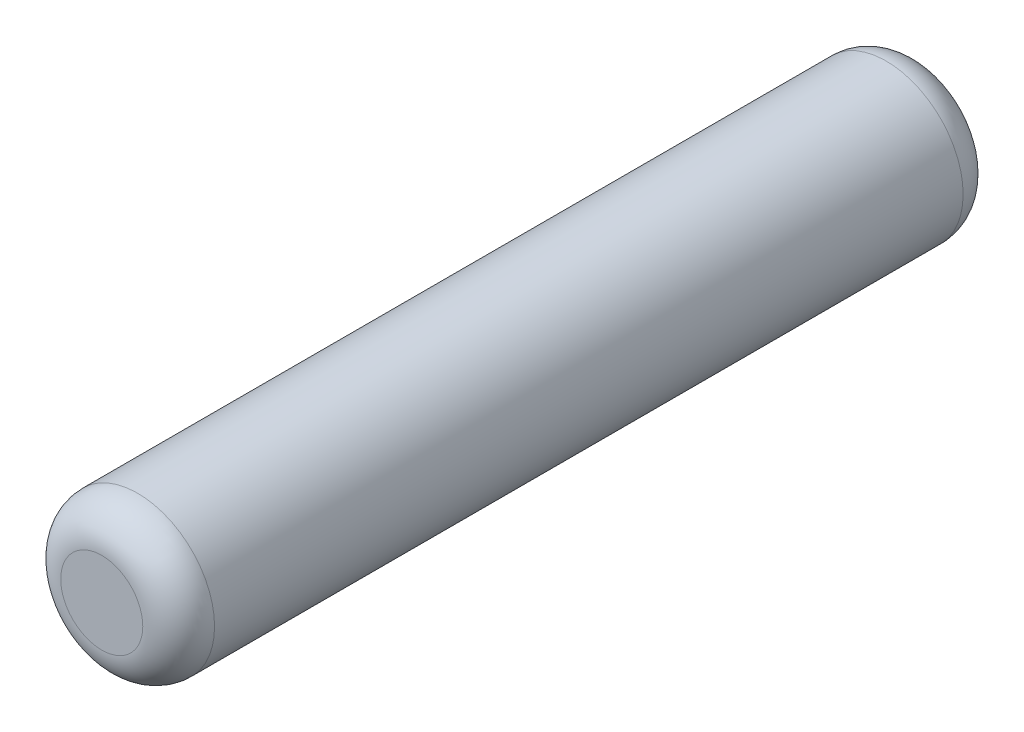
ISO-10303-21;
HEADER;
FILE_DESCRIPTION(('STEP AP214'),'2;1');
FILE_NAME('part.step','',(''),(''),'','','');
FILE_SCHEMA(('AUTOMOTIVE_DESIGN { 1 0 10303 214 1 1 1 1 }'));
ENDSEC;
DATA;
#1=APPLICATION_CONTEXT('core data for automotive mechanical design processes');
#2=APPLICATION_PROTOCOL_DEFINITION('international standard','automotive_design',2000,#1);
#3=PRODUCT_CONTEXT('',#1,'mechanical');
#4=PRODUCT('Part','Part','',(#3));
#5=PRODUCT_RELATED_PRODUCT_CATEGORY('part','',(#4));
#6=PRODUCT_DEFINITION_FORMATION('','',#4);
#7=PRODUCT_DEFINITION_CONTEXT('part definition',#1,'design');
#8=PRODUCT_DEFINITION('design','',#6,#7);
#9=PRODUCT_DEFINITION_SHAPE('','',#8);
#10=(LENGTH_UNIT() NAMED_UNIT(*) SI_UNIT(.MILLI.,.METRE.));
#11=(NAMED_UNIT(*) PLANE_ANGLE_UNIT() SI_UNIT($,.RADIAN.));
#12=(NAMED_UNIT(*) SI_UNIT($,.STERADIAN.) SOLID_ANGLE_UNIT());
#13=UNCERTAINTY_MEASURE_WITH_UNIT(LENGTH_MEASURE(1.E-05),#10,'distance_accuracy_value','');
#14=(GEOMETRIC_REPRESENTATION_CONTEXT(3) GLOBAL_UNCERTAINTY_ASSIGNED_CONTEXT((#13)) GLOBAL_UNIT_ASSIGNED_CONTEXT((#10,
#11,#12)) REPRESENTATION_CONTEXT('',''));
#15=CARTESIAN_POINT('',(0.,0.,0.));
#16=DIRECTION('',(0.,0.,1.));
#17=DIRECTION('',(1.,0.,0.));
#18=AXIS2_PLACEMENT_3D('',#15,#16,#17);
#19=CARTESIAN_POINT('',(0.,0.,4.));
#20=DIRECTION('',(0.,0.,-1.));
#21=DIRECTION('',(-1.,0.,0.));
#22=AXIS2_PLACEMENT_3D('',#19,#20,#21);
#23=CYLINDRICAL_SURFACE('',#22,0.75);
#24=CARTESIAN_POINT('',(0.,0.,-3.65));
#25=DIRECTION('',(0.,0.,1.));
#26=DIRECTION('',(1.,0.,0.));
#27=AXIS2_PLACEMENT_3D('',#24,#25,#26);
#28=CIRCLE('',#27,0.75);
#29=CARTESIAN_POINT('',(0.75,0.,-3.65));
#30=VERTEX_POINT('',#29);
#31=EDGE_CURVE('E42',#30,#30,#28,.T.);
#32=ORIENTED_EDGE('',*,*,#31,.T.);
#33=EDGE_LOOP('',(#32));
#34=FACE_BOUND('',#33,.T.);
#35=CARTESIAN_POINT('',(0.,0.,3.65));
#36=DIRECTION('',(0.,0.,1.));
#37=DIRECTION('',(1.,0.,0.));
#38=AXIS2_PLACEMENT_3D('',#35,#36,#37);
#39=CIRCLE('',#38,0.75);
#40=CARTESIAN_POINT('',(0.75,0.,3.65));
#41=VERTEX_POINT('',#40);
#42=EDGE_CURVE('E46',#41,#41,#39,.F.);
#43=ORIENTED_EDGE('',*,*,#42,.T.);
#44=EDGE_LOOP('',(#43));
#45=FACE_BOUND('',#44,.T.);
#46=ADVANCED_FACE('F31',(#34,#45),#23,.T.);
#47=CARTESIAN_POINT('',(0.,0.,4.));
#48=DIRECTION('',(0.,0.,1.));
#49=DIRECTION('',(1.,0.,0.));
#50=AXIS2_PLACEMENT_3D('',#47,#48,#49);
#51=PLANE('',#50);
#52=CARTESIAN_POINT('',(0.,0.,4.));
#53=DIRECTION('',(0.,0.,1.));
#54=DIRECTION('',(1.,0.,0.));
#55=AXIS2_PLACEMENT_3D('',#52,#53,#54);
#56=CIRCLE('',#55,0.4);
#57=CARTESIAN_POINT('',(0.4,0.,4.));
#58=VERTEX_POINT('',#57);
#59=EDGE_CURVE('E10',#58,#58,#56,.T.);
#60=ORIENTED_EDGE('',*,*,#59,.T.);
#61=EDGE_LOOP('',(#60));
#62=FACE_BOUND('',#61,.T.);
#63=ADVANCED_FACE('F62',(#62),#51,.T.);
#64=CARTESIAN_POINT('',(0.,0.,-4.));
#65=DIRECTION('',(0.,0.,1.));
#66=DIRECTION('',(1.,0.,0.));
#67=AXIS2_PLACEMENT_3D('',#64,#65,#66);
#68=PLANE('',#67);
#69=CARTESIAN_POINT('',(0.,0.,-4.));
#70=DIRECTION('',(0.,0.,1.));
#71=DIRECTION('',(1.,0.,0.));
#72=AXIS2_PLACEMENT_3D('',#69,#70,#71);
#73=CIRCLE('',#72,0.4);
#74=CARTESIAN_POINT('',(0.4,0.,-4.));
#75=VERTEX_POINT('',#74);
#76=EDGE_CURVE('E38',#75,#75,#73,.F.);
#77=ORIENTED_EDGE('',*,*,#76,.T.);
#78=EDGE_LOOP('',(#77));
#79=FACE_BOUND('',#78,.T.);
#80=ADVANCED_FACE('F59',(#79),#68,.F.);
#81=CARTESIAN_POINT('',(0.,0.,-3.65));
#82=DIRECTION('',(0.,0.,1.));
#83=DIRECTION('',(1.,0.,0.));
#84=AXIS2_PLACEMENT_3D('',#81,#82,#83);
#85=TOROIDAL_SURFACE('',#84,0.4,0.35);
#86=ORIENTED_EDGE('',*,*,#76,.F.);
#87=EDGE_LOOP('',(#86));
#88=FACE_BOUND('',#87,.T.);
#89=ORIENTED_EDGE('',*,*,#31,.F.);
#90=EDGE_LOOP('',(#89));
#91=FACE_BOUND('',#90,.T.);
#92=ADVANCED_FACE('F55',(#88,#91),#85,.T.);
#93=CARTESIAN_POINT('',(0.,0.,3.65));
#94=DIRECTION('',(0.,0.,1.));
#95=DIRECTION('',(1.,0.,0.));
#96=AXIS2_PLACEMENT_3D('',#93,#94,#95);
#97=TOROIDAL_SURFACE('',#96,0.4,0.35);
#98=ORIENTED_EDGE('',*,*,#42,.F.);
#99=EDGE_LOOP('',(#98));
#100=FACE_BOUND('',#99,.T.);
#101=ORIENTED_EDGE('',*,*,#59,.F.);
#102=EDGE_LOOP('',(#101));
#103=FACE_BOUND('',#102,.T.);
#104=ADVANCED_FACE('F33',(#100,#103),#97,.T.);
#105=CLOSED_SHELL('',(#46,#63,#80,#92,#104));
#106=MANIFOLD_SOLID_BREP('B2',#105);
#107=ADVANCED_BREP_SHAPE_REPRESENTATION('',(#18,#106),#14);
#108=SHAPE_DEFINITION_REPRESENTATION(#9,#107);
ENDSEC;
END-ISO-10303-21;
